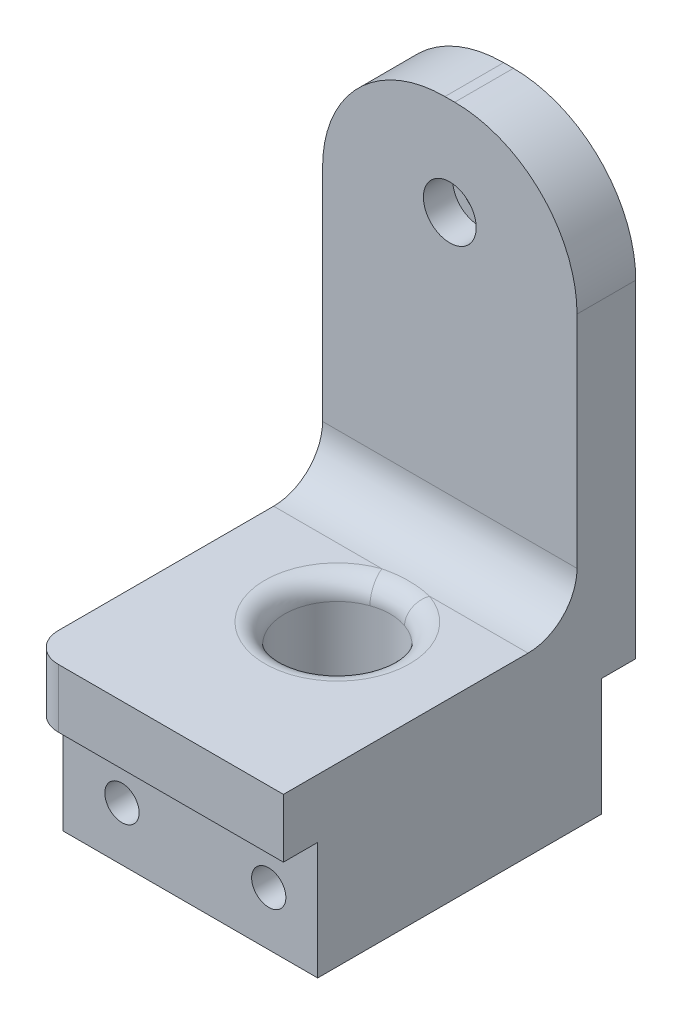
ISO-10303-21;
HEADER;
FILE_DESCRIPTION(('STEP AP214'),'2;1');
FILE_NAME('part.step','',(''),(''),'','','');
FILE_SCHEMA(('AUTOMOTIVE_DESIGN { 1 0 10303 214 1 1 1 1 }'));
ENDSEC;
DATA;
#1=APPLICATION_CONTEXT('core data for automotive mechanical design processes');
#2=APPLICATION_PROTOCOL_DEFINITION('international standard','automotive_design',2000,#1);
#3=PRODUCT_CONTEXT('',#1,'mechanical');
#4=PRODUCT('Part','Part','',(#3));
#5=PRODUCT_RELATED_PRODUCT_CATEGORY('part','',(#4));
#6=PRODUCT_DEFINITION_FORMATION('','',#4);
#7=PRODUCT_DEFINITION_CONTEXT('part definition',#1,'design');
#8=PRODUCT_DEFINITION('design','',#6,#7);
#9=PRODUCT_DEFINITION_SHAPE('','',#8);
#10=(LENGTH_UNIT() NAMED_UNIT(*) SI_UNIT(.MILLI.,.METRE.));
#11=(NAMED_UNIT(*) PLANE_ANGLE_UNIT() SI_UNIT($,.RADIAN.));
#12=(NAMED_UNIT(*) SI_UNIT($,.STERADIAN.) SOLID_ANGLE_UNIT());
#13=UNCERTAINTY_MEASURE_WITH_UNIT(LENGTH_MEASURE(1.E-05),#10,'distance_accuracy_value','');
#14=(GEOMETRIC_REPRESENTATION_CONTEXT(3) GLOBAL_UNCERTAINTY_ASSIGNED_CONTEXT((#13)) GLOBAL_UNIT_ASSIGNED_CONTEXT((#10,
#11,#12)) REPRESENTATION_CONTEXT('',''));
#15=CARTESIAN_POINT('',(0.,0.,0.));
#16=DIRECTION('',(0.,0.,1.));
#17=DIRECTION('',(1.,0.,0.));
#18=AXIS2_PLACEMENT_3D('',#15,#16,#17);
#19=CARTESIAN_POINT('',(37.2641007815364,-7.9999999999999,-28.));
#20=DIRECTION('',(0.,0.,1.));
#21=DIRECTION('',(1.,0.,0.));
#22=AXIS2_PLACEMENT_3D('',#19,#20,#21);
#23=CYLINDRICAL_SURFACE('',#22,2.7);
#24=CARTESIAN_POINT('',(37.2641007815364,-7.9999999999999,-22.));
#25=DIRECTION('',(0.,0.,1.));
#26=DIRECTION('',(1.,0.,0.));
#27=AXIS2_PLACEMENT_3D('',#24,#25,#26);
#28=CIRCLE('',#27,2.7);
#29=CARTESIAN_POINT('',(39.9641007815364,-7.9999999999999,-22.));
#30=VERTEX_POINT('',#29);
#31=EDGE_CURVE('E368',#30,#30,#28,.T.);
#32=ORIENTED_EDGE('',*,*,#31,.T.);
#33=EDGE_LOOP('',(#32));
#34=FACE_BOUND('',#33,.T.);
#35=CARTESIAN_POINT('',(37.2641007815364,-7.9999999999999,-25.));
#36=DIRECTION('',(0.,0.,-1.));
#37=DIRECTION('',(0.,1.,0.));
#38=AXIS2_PLACEMENT_3D('',#35,#36,#37);
#39=CIRCLE('',#38,2.7);
#40=CARTESIAN_POINT('',(37.2641007815364,-5.29999999999991,-25.));
#41=VERTEX_POINT('',#40);
#42=EDGE_CURVE('E11',#41,#41,#39,.F.);
#43=ORIENTED_EDGE('',*,*,#42,.F.);
#44=EDGE_LOOP('',(#43));
#45=FACE_BOUND('',#44,.T.);
#46=ADVANCED_FACE('F34',(#34,#45),#23,.F.);
#47=CARTESIAN_POINT('',(24.2641007815365,-38.,5.00000000000002));
#48=DIRECTION('',(1.,0.,0.));
#49=DIRECTION('',(0.,1.,0.));
#50=AXIS2_PLACEMENT_3D('',#47,#48,#49);
#51=PLANE('',#50);
#52=DIRECTION('',(0.,0.,1.));
#53=VECTOR('',#52,1.);
#54=CARTESIAN_POINT('',(24.2641007815365,-10.5,5.00000000000002));
#55=LINE('',#54,#53);
#56=CARTESIAN_POINT('',(24.2641007815365,-10.5,-22.));
#57=VERTEX_POINT('',#56);
#58=CARTESIAN_POINT('',(24.2641007815365,-10.5,-25.));
#59=VERTEX_POINT('',#58);
#60=EDGE_CURVE('E190',#57,#59,#55,.F.);
#61=ORIENTED_EDGE('',*,*,#60,.T.);
#62=DIRECTION('',(0.,-1.,0.));
#63=VECTOR('',#62,1.);
#64=CARTESIAN_POINT('',(24.2641007815365,-38.,-25.));
#65=LINE('',#64,#63);
#66=CARTESIAN_POINT('',(24.2641007815365,-44.,-25.));
#67=VERTEX_POINT('',#66);
#68=EDGE_CURVE('E174',#59,#67,#65,.T.);
#69=ORIENTED_EDGE('',*,*,#68,.T.);
#70=DIRECTION('',(0.,0.,1.));
#71=VECTOR('',#70,1.);
#72=CARTESIAN_POINT('',(24.2641007815365,-44.,5.00000000000002));
#73=LINE('',#72,#71);
#74=CARTESIAN_POINT('',(24.2641007815365,-44.,-24.5000000000061));
#75=VERTEX_POINT('',#74);
#76=EDGE_CURVE('E324',#67,#75,#73,.T.);
#77=ORIENTED_EDGE('',*,*,#76,.T.);
#78=DIRECTION('',(0.,1.,0.));
#79=VECTOR('',#78,1.);
#80=CARTESIAN_POINT('',(24.2641007815351,-56.,-24.5000000000061));
#81=LINE('',#80,#79);
#82=CARTESIAN_POINT('',(24.2641007815351,-56.,-24.5000000000061));
#83=VERTEX_POINT('',#82);
#84=EDGE_CURVE('E406',#83,#75,#81,.T.);
#85=ORIENTED_EDGE('',*,*,#84,.F.);
#86=DIRECTION('',(0.,0.,-1.));
#87=VECTOR('',#86,1.);
#88=CARTESIAN_POINT('',(24.2641007815351,-56.,4.49999999999388));
#89=LINE('',#88,#87);
#90=CARTESIAN_POINT('',(24.2641007815351,-56.,4.49999999999388));
#91=VERTEX_POINT('',#90);
#92=EDGE_CURVE('E419',#91,#83,#89,.T.);
#93=ORIENTED_EDGE('',*,*,#92,.F.);
#94=DIRECTION('',(0.,1.,0.));
#95=VECTOR('',#94,1.);
#96=CARTESIAN_POINT('',(24.2641007815351,-56.,4.49999999999388));
#97=LINE('',#96,#95);
#98=CARTESIAN_POINT('',(24.2641007815365,-44.,4.49999999999388));
#99=VERTEX_POINT('',#98);
#100=EDGE_CURVE('E386',#91,#99,#97,.T.);
#101=ORIENTED_EDGE('',*,*,#100,.T.);
#102=CARTESIAN_POINT('',(24.2641007815365,-44.,5.00000000000002));
#103=VERTEX_POINT('',#102);
#104=EDGE_CURVE('E380',#99,#103,#73,.T.);
#105=ORIENTED_EDGE('',*,*,#104,.T.);
#106=DIRECTION('',(0.,-1.,0.));
#107=VECTOR('',#106,1.);
#108=CARTESIAN_POINT('',(24.2641007815365,-38.,5.00000000000002));
#109=LINE('',#108,#107);
#110=CARTESIAN_POINT('',(24.2641007815365,-38.,5.00000000000002));
#111=VERTEX_POINT('',#110);
#112=EDGE_CURVE('E321',#111,#103,#109,.T.);
#113=ORIENTED_EDGE('',*,*,#112,.F.);
#114=DIRECTION('',(0.,0.,1.));
#115=VECTOR('',#114,1.);
#116=CARTESIAN_POINT('',(24.2641007815365,-38.,5.00000000000002));
#117=LINE('',#116,#115);
#118=CARTESIAN_POINT('',(24.2641007815365,-38.,-17.));
#119=VERTEX_POINT('',#118);
#120=EDGE_CURVE('E339',#119,#111,#117,.T.);
#121=ORIENTED_EDGE('',*,*,#120,.F.);
#122=CARTESIAN_POINT('',(24.2641007815365,-33.,-17.));
#123=DIRECTION('',(1.,0.,0.));
#124=DIRECTION('',(0.,1.,0.));
#125=AXIS2_PLACEMENT_3D('',#122,#123,#124);
#126=CIRCLE('',#125,5.);
#127=CARTESIAN_POINT('',(24.2641007815365,-33.,-22.));
#128=VERTEX_POINT('',#127);
#129=EDGE_CURVE('E179',#119,#128,#126,.T.);
#130=ORIENTED_EDGE('',*,*,#129,.T.);
#131=DIRECTION('',(0.,-1.,0.));
#132=VECTOR('',#131,1.);
#133=CARTESIAN_POINT('',(24.2641007815365,2.00000000000004,-22.));
#134=LINE('',#133,#132);
#135=EDGE_CURVE('E355',#57,#128,#134,.T.);
#136=ORIENTED_EDGE('',*,*,#135,.F.);
#137=EDGE_LOOP('',(#61,#69,#77,#85,#93,#101,#105,#113,#121,#130,#136));
#138=FACE_BOUND('',#137,.T.);
#139=ADVANCED_FACE('F269',(#138),#51,.F.);
#140=CARTESIAN_POINT('',(27.2641007815365,-44.,-25.));
#141=DIRECTION('',(0.,1.,0.));
#142=DIRECTION('',(-1.,0.,0.));
#143=AXIS2_PLACEMENT_3D('',#140,#141,#142);
#144=PLANE('',#143);
#145=DIRECTION('',(-1.,0.,0.));
#146=VECTOR('',#145,1.);
#147=CARTESIAN_POINT('',(24.2641007815351,-44.,4.49999999999388));
#148=LINE('',#147,#146);
#149=CARTESIAN_POINT('',(50.2641007815364,-44.,4.49999999999388));
#150=VERTEX_POINT('',#149);
#151=EDGE_CURVE('E388',#150,#99,#148,.T.);
#152=ORIENTED_EDGE('',*,*,#151,.F.);
#153=DIRECTION('',(0.,0.,-1.));
#154=VECTOR('',#153,1.);
#155=CARTESIAN_POINT('',(50.2641007815364,-44.,8.00000000000001));
#156=LINE('',#155,#154);
#157=CARTESIAN_POINT('',(50.2641007815364,-44.,8.00000000000001));
#158=VERTEX_POINT('',#157);
#159=EDGE_CURVE('E333',#158,#150,#156,.T.);
#160=ORIENTED_EDGE('',*,*,#159,.F.);
#161=DIRECTION('',(1.,0.,0.));
#162=VECTOR('',#161,1.);
#163=CARTESIAN_POINT('',(50.2641007815364,-44.,8.00000000000001));
#164=LINE('',#163,#162);
#165=CARTESIAN_POINT('',(27.2641007815365,-44.,8.00000000000002));
#166=VERTEX_POINT('',#165);
#167=EDGE_CURVE('E323',#166,#158,#164,.T.);
#168=ORIENTED_EDGE('',*,*,#167,.F.);
#169=CARTESIAN_POINT('',(27.2641007815365,-44.,5.00000000000002));
#170=DIRECTION('',(0.,1.,0.));
#171=DIRECTION('',(-1.,0.,0.));
#172=AXIS2_PLACEMENT_3D('',#169,#170,#171);
#173=CIRCLE('',#172,3.);
#174=EDGE_CURVE('E315',#103,#166,#173,.T.);
#175=ORIENTED_EDGE('',*,*,#174,.F.);
#176=ORIENTED_EDGE('',*,*,#104,.F.);
#177=EDGE_LOOP('',(#152,#160,#168,#175,#176));
#178=FACE_BOUND('',#177,.T.);
#179=ADVANCED_FACE('F275',(#178),#144,.F.);
#180=DIRECTION('',(1.,0.,0.));
#181=VECTOR('',#180,1.);
#182=CARTESIAN_POINT('',(50.264100781536,-44.,-24.5000000000061));
#183=LINE('',#182,#181);
#184=CARTESIAN_POINT('',(50.264100781536,-44.,-24.5000000000061));
#185=VERTEX_POINT('',#184);
#186=EDGE_CURVE('E391',#75,#185,#183,.T.);
#187=ORIENTED_EDGE('',*,*,#186,.F.);
#188=ORIENTED_EDGE('',*,*,#76,.F.);
#189=CARTESIAN_POINT('',(27.2641007815365,-44.,-25.));
#190=DIRECTION('',(0.,1.,0.));
#191=DIRECTION('',(-1.,0.,0.));
#192=AXIS2_PLACEMENT_3D('',#189,#190,#191);
#193=CIRCLE('',#192,3.);
#194=CARTESIAN_POINT('',(27.2641007815365,-44.,-28.));
#195=VERTEX_POINT('',#194);
#196=EDGE_CURVE('E373',#195,#67,#193,.T.);
#197=ORIENTED_EDGE('',*,*,#196,.F.);
#198=DIRECTION('',(-1.,0.,0.));
#199=VECTOR('',#198,1.);
#200=CARTESIAN_POINT('',(27.2641007815365,-44.,-28.));
#201=LINE('',#200,#199);
#202=CARTESIAN_POINT('',(50.2641007815364,-44.,-28.));
#203=VERTEX_POINT('',#202);
#204=EDGE_CURVE('E163',#203,#195,#201,.T.);
#205=ORIENTED_EDGE('',*,*,#204,.F.);
#206=EDGE_CURVE('E334',#185,#203,#156,.T.);
#207=ORIENTED_EDGE('',*,*,#206,.F.);
#208=EDGE_LOOP('',(#187,#188,#197,#205,#207));
#209=FACE_BOUND('',#208,.T.);
#210=ADVANCED_FACE('F294',(#209),#144,.F.);
#211=CARTESIAN_POINT('',(27.2641007815365,-38.,-25.));
#212=DIRECTION('',(0.,-1.,0.));
#213=DIRECTION('',(1.,0.,0.));
#214=AXIS2_PLACEMENT_3D('',#211,#212,#213);
#215=CYLINDRICAL_SURFACE('',#214,3.);
#216=ORIENTED_EDGE('',*,*,#196,.T.);
#217=ORIENTED_EDGE('',*,*,#68,.F.);
#218=CARTESIAN_POINT('',(27.2641007815365,-2.37596159536399,-28.));
#219=CARTESIAN_POINT('',(27.1983915563576,-2.45279744131092,-27.9999955976834));
#220=CARTESIAN_POINT('',(27.1336332208816,-2.53041391033352,-27.9978417404232));
#221=CARTESIAN_POINT('',(27.0061348726776,-2.68704359475026,-27.9895716775174));
#222=CARTESIAN_POINT('',(26.9433942499425,-2.76605637659331,-27.9834566814753));
#223=CARTESIAN_POINT('',(26.7585647009284,-3.00469045812072,-27.959704568562));
#224=CARTESIAN_POINT('',(26.6396007444813,-3.16622036865482,-27.9366575549089));
#225=CARTESIAN_POINT('',(26.4114725614061,-3.49197987139293,-27.8786750178079));
#226=CARTESIAN_POINT('',(26.3022386295532,-3.65617824575292,-27.8438344065246));
#227=CARTESIAN_POINT('',(26.092615906032,-3.98786265558461,-27.7640912771896));
#228=CARTESIAN_POINT('',(25.9922329943069,-4.1553507875322,-27.719182139508));
#229=CARTESIAN_POINT('',(25.7456081410414,-4.58934552659574,-27.5928509406924));
#230=CARTESIAN_POINT('',(25.6059101592015,-4.85778298644404,-27.505222332294));
#231=CARTESIAN_POINT('',(25.3481827231032,-5.39933018880595,-27.3140874879935));
#232=CARTESIAN_POINT('',(25.2301611975324,-5.67244160115889,-27.210575467659));
#233=CARTESIAN_POINT('',(25.014695207921,-6.22339230843005,-26.9909664833123));
#234=CARTESIAN_POINT('',(24.9173529043281,-6.50124806954949,-26.8748111382131));
#235=CARTESIAN_POINT('',(24.743394548052,-7.05935448987318,-26.6334491837794));
#236=CARTESIAN_POINT('',(24.6667743765311,-7.33960466171114,-26.5082443794409));
#237=CARTESIAN_POINT('',(24.4880428632665,-8.09465490011339,-26.1632015719856));
#238=CARTESIAN_POINT('',(24.4044538691434,-8.57114570459951,-25.9373197299402));
#239=CARTESIAN_POINT('',(24.2929474397417,-9.5251737303016,-25.4775191262234));
#240=CARTESIAN_POINT('',(24.2648830871325,-10.0027048339925,-25.2436232444146));
#241=CARTESIAN_POINT('',(24.2641061639584,-10.4866130721461,-25.0065582272683));
#242=CARTESIAN_POINT('',(24.2641007879001,-10.4933065692224,-25.0032790967264));
#243=CARTESIAN_POINT('',(24.2641007815365,-10.5,-25.));
#244=B_SPLINE_CURVE_WITH_KNOTS('',3,(#218,#219,#220,#221,#222,#223,#224,#225,#226,#227,#228,
#229,#230,#231,#232,#233,#234,#235,#236,#237,#238,#239,#240,#241,#242,#243),.UNSPECIFIED.,.F.,
.F.,(4,2,2,2,2,2,2,2,2,2,2,2,4),(0.,0.303232002971017,0.60637145232173,1.21142014160019,
1.81171094338183,2.41239757437573,3.35608082014014,4.300108556401,5.24869681288445,
6.19709638427291,7.79552777701962,9.38972405871274,9.41208474430548),.UNSPECIFIED.);
#245=CARTESIAN_POINT('',(27.2641007815365,-2.37596159536399,-28.));
#246=VERTEX_POINT('',#245);
#247=EDGE_CURVE('E171',#59,#246,#244,.F.);
#248=ORIENTED_EDGE('',*,*,#247,.T.);
#249=DIRECTION('',(0.,-1.,0.));
#250=VECTOR('',#249,1.);
#251=CARTESIAN_POINT('',(27.2641007815365,-38.,-28.));
#252=LINE('',#251,#250);
#253=EDGE_CURVE('E153',#246,#195,#252,.T.);
#254=ORIENTED_EDGE('',*,*,#253,.T.);
#255=EDGE_LOOP('',(#216,#217,#248,#254));
#256=FACE_BOUND('',#255,.T.);
#257=ADVANCED_FACE('F172',(#256),#215,.T.);
#258=CARTESIAN_POINT('',(27.2641007815365,-38.,5.00000000000002));
#259=DIRECTION('',(0.,-1.,0.));
#260=DIRECTION('',(1.,0.,0.));
#261=AXIS2_PLACEMENT_3D('',#258,#259,#260);
#262=CYLINDRICAL_SURFACE('',#261,3.);
#263=ORIENTED_EDGE('',*,*,#174,.T.);
#264=DIRECTION('',(0.,-1.,0.));
#265=VECTOR('',#264,1.);
#266=CARTESIAN_POINT('',(27.2641007815365,-38.,8.00000000000002));
#267=LINE('',#266,#265);
#268=CARTESIAN_POINT('',(27.2641007815365,-38.,8.00000000000002));
#269=VERTEX_POINT('',#268);
#270=EDGE_CURVE('E318',#269,#166,#267,.T.);
#271=ORIENTED_EDGE('',*,*,#270,.F.);
#272=CARTESIAN_POINT('',(27.2641007815365,-38.,5.00000000000002));
#273=DIRECTION('',(0.,1.,0.));
#274=DIRECTION('',(-1.,0.,0.));
#275=AXIS2_PLACEMENT_3D('',#272,#273,#274);
#276=CIRCLE('',#275,3.);
#277=EDGE_CURVE('E375',#111,#269,#276,.T.);
#278=ORIENTED_EDGE('',*,*,#277,.F.);
#279=ORIENTED_EDGE('',*,*,#112,.T.);
#280=EDGE_LOOP('',(#263,#271,#278,#279));
#281=FACE_BOUND('',#280,.T.);
#282=ADVANCED_FACE('F305',(#281),#262,.T.);
#283=CARTESIAN_POINT('',(50.2641007815364,-38.,8.00000000000001));
#284=DIRECTION('',(0.,0.,-1.));
#285=DIRECTION('',(-1.,0.,0.));
#286=AXIS2_PLACEMENT_3D('',#283,#284,#285);
#287=PLANE('',#286);
#288=ORIENTED_EDGE('',*,*,#167,.T.);
#289=DIRECTION('',(0.,-1.,0.));
#290=VECTOR('',#289,1.);
#291=CARTESIAN_POINT('',(50.2641007815364,-38.,8.00000000000001));
#292=LINE('',#291,#290);
#293=CARTESIAN_POINT('',(50.2641007815364,-38.,8.00000000000001));
#294=VERTEX_POINT('',#293);
#295=EDGE_CURVE('E329',#294,#158,#292,.T.);
#296=ORIENTED_EDGE('',*,*,#295,.F.);
#297=DIRECTION('',(1.,0.,0.));
#298=VECTOR('',#297,1.);
#299=CARTESIAN_POINT('',(50.2641007815364,-38.,8.00000000000001));
#300=LINE('',#299,#298);
#301=EDGE_CURVE('E328',#269,#294,#300,.T.);
#302=ORIENTED_EDGE('',*,*,#301,.F.);
#303=ORIENTED_EDGE('',*,*,#270,.T.);
#304=EDGE_LOOP('',(#288,#296,#302,#303));
#305=FACE_BOUND('',#304,.T.);
#306=ADVANCED_FACE('F301',(#305),#287,.F.);
#307=CARTESIAN_POINT('',(50.2641007815364,-38.,8.00000000000001));
#308=DIRECTION('',(-1.,0.,0.));
#309=DIRECTION('',(0.,-1.,0.));
#310=AXIS2_PLACEMENT_3D('',#307,#308,#309);
#311=PLANE('',#310);
#312=DIRECTION('',(0.,-1.,0.));
#313=VECTOR('',#312,1.);
#314=CARTESIAN_POINT('',(50.2641007815364,-38.,-28.));
#315=LINE('',#314,#313);
#316=CARTESIAN_POINT('',(50.2641007815364,-10.5,-28.));
#317=VERTEX_POINT('',#316);
#318=EDGE_CURVE('E167',#317,#203,#315,.T.);
#319=ORIENTED_EDGE('',*,*,#318,.F.);
#320=DIRECTION('',(0.,0.,-1.));
#321=VECTOR('',#320,1.);
#322=CARTESIAN_POINT('',(50.2641007815364,-10.5,8.00000000000001));
#323=LINE('',#322,#321);
#324=CARTESIAN_POINT('',(50.2641007815364,-10.5,-22.));
#325=VERTEX_POINT('',#324);
#326=EDGE_CURVE('E185',#317,#325,#323,.F.);
#327=ORIENTED_EDGE('',*,*,#326,.T.);
#328=DIRECTION('',(0.,-1.,0.));
#329=VECTOR('',#328,1.);
#330=CARTESIAN_POINT('',(50.2641007815364,2.00000000000004,-22.));
#331=LINE('',#330,#329);
#332=CARTESIAN_POINT('',(50.2641007815364,-33.,-22.));
#333=VERTEX_POINT('',#332);
#334=EDGE_CURVE('E364',#325,#333,#331,.T.);
#335=ORIENTED_EDGE('',*,*,#334,.T.);
#336=CARTESIAN_POINT('',(50.2641007815364,-33.,-17.));
#337=DIRECTION('',(-1.,0.,0.));
#338=DIRECTION('',(0.,-1.,0.));
#339=AXIS2_PLACEMENT_3D('',#336,#337,#338);
#340=CIRCLE('',#339,5.);
#341=CARTESIAN_POINT('',(50.2641007815364,-38.,-17.));
#342=VERTEX_POINT('',#341);
#343=EDGE_CURVE('E199',#333,#342,#340,.T.);
#344=ORIENTED_EDGE('',*,*,#343,.T.);
#345=DIRECTION('',(0.,0.,-1.));
#346=VECTOR('',#345,1.);
#347=CARTESIAN_POINT('',(50.2641007815364,-38.,8.00000000000001));
#348=LINE('',#347,#346);
#349=EDGE_CURVE('E168',#294,#342,#348,.T.);
#350=ORIENTED_EDGE('',*,*,#349,.F.);
#351=ORIENTED_EDGE('',*,*,#295,.T.);
#352=ORIENTED_EDGE('',*,*,#159,.T.);
#353=DIRECTION('',(0.,1.,0.));
#354=VECTOR('',#353,1.);
#355=CARTESIAN_POINT('',(50.264100781536,-56.,4.49999999999388));
#356=LINE('',#355,#354);
#357=CARTESIAN_POINT('',(50.264100781536,-56.,4.49999999999388));
#358=VERTEX_POINT('',#357);
#359=EDGE_CURVE('E397',#358,#150,#356,.T.);
#360=ORIENTED_EDGE('',*,*,#359,.F.);
#361=DIRECTION('',(0.,0.,1.));
#362=VECTOR('',#361,1.);
#363=CARTESIAN_POINT('',(50.264100781536,-56.,4.49999999999388));
#364=LINE('',#363,#362);
#365=CARTESIAN_POINT('',(50.264100781536,-56.,-24.5000000000061));
#366=VERTEX_POINT('',#365);
#367=EDGE_CURVE('E403',#366,#358,#364,.T.);
#368=ORIENTED_EDGE('',*,*,#367,.F.);
#369=DIRECTION('',(0.,1.,0.));
#370=VECTOR('',#369,1.);
#371=CARTESIAN_POINT('',(50.264100781536,-56.,-24.5000000000061));
#372=LINE('',#371,#370);
#373=EDGE_CURVE('E402',#366,#185,#372,.T.);
#374=ORIENTED_EDGE('',*,*,#373,.T.);
#375=ORIENTED_EDGE('',*,*,#206,.T.);
#376=EDGE_LOOP('',(#319,#327,#335,#344,#350,#351,#352,#360,#368,#374,#375));
#377=FACE_BOUND('',#376,.T.);
#378=ADVANCED_FACE('F298',(#377),#311,.F.);
#379=CARTESIAN_POINT('',(27.2641007815365,-38.,-28.));
#380=DIRECTION('',(0.,0.,1.));
#381=DIRECTION('',(0.,-1.,0.));
#382=AXIS2_PLACEMENT_3D('',#379,#380,#381);
#383=PLANE('',#382);
#384=ORIENTED_EDGE('',*,*,#253,.F.);
#385=CARTESIAN_POINT('',(36.7641007815365,-10.5,-28.));
#386=DIRECTION('',(0.,0.,1.));
#387=DIRECTION('',(0.,-1.,0.));
#388=AXIS2_PLACEMENT_3D('',#385,#386,#387);
#389=CIRCLE('',#388,12.5);
#390=CARTESIAN_POINT('',(36.7641007815365,2.00000000000004,-28.));
#391=VERTEX_POINT('',#390);
#392=EDGE_CURVE('E159',#246,#391,#389,.F.);
#393=ORIENTED_EDGE('',*,*,#392,.T.);
#394=DIRECTION('',(-1.,0.,0.));
#395=VECTOR('',#394,1.);
#396=CARTESIAN_POINT('',(50.2641007815364,2.00000000000004,-28.));
#397=LINE('',#396,#395);
#398=CARTESIAN_POINT('',(37.7641007815364,2.00000000000004,-28.));
#399=VERTEX_POINT('',#398);
#400=EDGE_CURVE('E361',#399,#391,#397,.T.);
#401=ORIENTED_EDGE('',*,*,#400,.F.);
#402=CARTESIAN_POINT('',(37.7641007815364,-10.5,-28.));
#403=DIRECTION('',(0.,0.,1.));
#404=DIRECTION('',(0.,-1.,0.));
#405=AXIS2_PLACEMENT_3D('',#402,#403,#404);
#406=CIRCLE('',#405,12.5);
#407=EDGE_CURVE('E186',#399,#317,#406,.F.);
#408=ORIENTED_EDGE('',*,*,#407,.T.);
#409=ORIENTED_EDGE('',*,*,#318,.T.);
#410=ORIENTED_EDGE('',*,*,#204,.T.);
#411=EDGE_LOOP('',(#384,#393,#401,#408,#409,#410));
#412=FACE_BOUND('',#411,.T.);
#413=CARTESIAN_POINT('',(37.2641007815364,-7.9999999999999,-28.));
#414=DIRECTION('',(0.,0.,-1.));
#415=DIRECTION('',(0.,1.,0.));
#416=AXIS2_PLACEMENT_3D('',#413,#414,#415);
#417=CIRCLE('',#416,1.6);
#418=CARTESIAN_POINT('',(37.2641007815364,-6.39999999999991,-28.));
#419=VERTEX_POINT('',#418);
#420=EDGE_CURVE('E547',#419,#419,#417,.T.);
#421=ORIENTED_EDGE('',*,*,#420,.F.);
#422=EDGE_LOOP('',(#421));
#423=FACE_BOUND('',#422,.T.);
#424=ADVANCED_FACE('F155',(#412,#423),#383,.F.);
#425=CARTESIAN_POINT('',(27.2641007815365,-38.,-25.));
#426=DIRECTION('',(0.,1.,0.));
#427=DIRECTION('',(-1.,0.,0.));
#428=AXIS2_PLACEMENT_3D('',#425,#426,#427);
#429=PLANE('',#428);
#430=DIRECTION('',(1.,0.,0.));
#431=VECTOR('',#430,1.);
#432=CARTESIAN_POINT('',(27.2641007815365,-38.,-17.));
#433=LINE('',#432,#431);
#434=CARTESIAN_POINT('',(40.1884047196501,-38.,-17.));
#435=VERTEX_POINT('',#434);
#436=EDGE_CURVE('E197',#342,#435,#433,.F.);
#437=ORIENTED_EDGE('',*,*,#436,.T.);
#438=CARTESIAN_POINT('',(37.7641007815366,-38.,-10.0083799863231));
#439=DIRECTION('',(0.,1.,0.));
#440=DIRECTION('',(-1.,0.,0.));
#441=AXIS2_PLACEMENT_3D('',#438,#439,#440);
#442=CIRCLE('',#441,7.4);
#443=CARTESIAN_POINT('',(35.339796843423,-38.,-17.));
#444=VERTEX_POINT('',#443);
#445=EDGE_CURVE('E42',#435,#444,#442,.F.);
#446=ORIENTED_EDGE('',*,*,#445,.T.);
#447=EDGE_CURVE('E196',#444,#119,#433,.F.);
#448=ORIENTED_EDGE('',*,*,#447,.T.);
#449=ORIENTED_EDGE('',*,*,#120,.T.);
#450=ORIENTED_EDGE('',*,*,#277,.T.);
#451=ORIENTED_EDGE('',*,*,#301,.T.);
#452=ORIENTED_EDGE('',*,*,#349,.T.);
#453=EDGE_LOOP('',(#437,#446,#448,#449,#450,#451,#452));
#454=FACE_BOUND('',#453,.T.);
#455=ADVANCED_FACE('F288',(#454),#429,.T.);
#456=CARTESIAN_POINT('',(50.2641007815364,2.00000000000004,-22.));
#457=DIRECTION('',(0.,0.,-1.));
#458=DIRECTION('',(-1.,0.,0.));
#459=AXIS2_PLACEMENT_3D('',#456,#457,#458);
#460=PLANE('',#459);
#461=ORIENTED_EDGE('',*,*,#31,.F.);
#462=EDGE_LOOP('',(#461));
#463=FACE_BOUND('',#462,.T.);
#464=ORIENTED_EDGE('',*,*,#135,.T.);
#465=DIRECTION('',(1.,0.,0.));
#466=VECTOR('',#465,1.);
#467=CARTESIAN_POINT('',(50.2641007815364,-33.,-22.));
#468=LINE('',#467,#466);
#469=EDGE_CURVE('E188',#128,#333,#468,.T.);
#470=ORIENTED_EDGE('',*,*,#469,.T.);
#471=ORIENTED_EDGE('',*,*,#334,.F.);
#472=CARTESIAN_POINT('',(37.7641007815364,-10.5,-22.));
#473=DIRECTION('',(0.,0.,-1.));
#474=DIRECTION('',(-1.,0.,0.));
#475=AXIS2_PLACEMENT_3D('',#472,#473,#474);
#476=CIRCLE('',#475,12.5);
#477=CARTESIAN_POINT('',(37.7641007815364,2.00000000000004,-22.));
#478=VERTEX_POINT('',#477);
#479=EDGE_CURVE('E349',#325,#478,#476,.F.);
#480=ORIENTED_EDGE('',*,*,#479,.T.);
#481=DIRECTION('',(1.,0.,0.));
#482=VECTOR('',#481,1.);
#483=CARTESIAN_POINT('',(50.2641007815364,2.00000000000004,-22.));
#484=LINE('',#483,#482);
#485=CARTESIAN_POINT('',(36.7641007815365,2.00000000000004,-22.));
#486=VERTEX_POINT('',#485);
#487=EDGE_CURVE('E359',#486,#478,#484,.T.);
#488=ORIENTED_EDGE('',*,*,#487,.F.);
#489=CARTESIAN_POINT('',(36.7641007815365,-10.5,-22.));
#490=DIRECTION('',(0.,0.,-1.));
#491=DIRECTION('',(-1.,0.,0.));
#492=AXIS2_PLACEMENT_3D('',#489,#490,#491);
#493=CIRCLE('',#492,12.5);
#494=EDGE_CURVE('E351',#486,#57,#493,.F.);
#495=ORIENTED_EDGE('',*,*,#494,.T.);
#496=EDGE_LOOP('',(#464,#470,#471,#480,#488,#495));
#497=FACE_BOUND('',#496,.T.);
#498=ADVANCED_FACE('F284',(#463,#497),#460,.F.);
#499=CARTESIAN_POINT('',(0.,2.00000000000005,0.));
#500=DIRECTION('',(0.,-1.,0.));
#501=DIRECTION('',(1.,0.,0.));
#502=AXIS2_PLACEMENT_3D('',#499,#500,#501);
#503=PLANE('',#502);
#504=ORIENTED_EDGE('',*,*,#400,.T.);
#505=DIRECTION('',(0.,0.,1.));
#506=VECTOR('',#505,1.);
#507=CARTESIAN_POINT('',(36.7641007815365,2.00000000000004,0.));
#508=LINE('',#507,#506);
#509=EDGE_CURVE('E184',#391,#486,#508,.T.);
#510=ORIENTED_EDGE('',*,*,#509,.T.);
#511=ORIENTED_EDGE('',*,*,#487,.T.);
#512=DIRECTION('',(0.,0.,-1.));
#513=VECTOR('',#512,1.);
#514=CARTESIAN_POINT('',(37.7641007815364,2.00000000000004,0.));
#515=LINE('',#514,#513);
#516=EDGE_CURVE('E345',#478,#399,#515,.T.);
#517=ORIENTED_EDGE('',*,*,#516,.T.);
#518=EDGE_LOOP('',(#504,#510,#511,#517));
#519=FACE_BOUND('',#518,.T.);
#520=ADVANCED_FACE('F222',(#519),#503,.F.);
#521=CARTESIAN_POINT('',(36.7641007815365,-10.5,0.));
#522=DIRECTION('',(0.,0.,1.));
#523=DIRECTION('',(1.,0.,0.));
#524=AXIS2_PLACEMENT_3D('',#521,#522,#523);
#525=CYLINDRICAL_SURFACE('',#524,12.5);
#526=ORIENTED_EDGE('',*,*,#247,.F.);
#527=ORIENTED_EDGE('',*,*,#60,.F.);
#528=ORIENTED_EDGE('',*,*,#494,.F.);
#529=ORIENTED_EDGE('',*,*,#509,.F.);
#530=ORIENTED_EDGE('',*,*,#392,.F.);
#531=EDGE_LOOP('',(#526,#527,#528,#529,#530));
#532=FACE_BOUND('',#531,.T.);
#533=ADVANCED_FACE('F182',(#532),#525,.T.);
#534=CARTESIAN_POINT('',(37.7641007815364,-10.5,0.));
#535=DIRECTION('',(0.,0.,-1.));
#536=DIRECTION('',(-1.,0.,0.));
#537=AXIS2_PLACEMENT_3D('',#534,#535,#536);
#538=CYLINDRICAL_SURFACE('',#537,12.5);
#539=ORIENTED_EDGE('',*,*,#479,.F.);
#540=ORIENTED_EDGE('',*,*,#326,.F.);
#541=ORIENTED_EDGE('',*,*,#407,.F.);
#542=ORIENTED_EDGE('',*,*,#516,.F.);
#543=EDGE_LOOP('',(#539,#540,#541,#542));
#544=FACE_BOUND('',#543,.T.);
#545=ADVANCED_FACE('F221',(#544),#538,.T.);
#546=CARTESIAN_POINT('',(24.2641007815351,-56.,4.49999999999388));
#547=DIRECTION('',(0.,0.,-1.));
#548=DIRECTION('',(-1.,0.,0.));
#549=AXIS2_PLACEMENT_3D('',#546,#547,#548);
#550=PLANE('',#549);
#551=CARTESIAN_POINT('',(45.2641007815367,-50.5,4.49999999999388));
#552=DIRECTION('',(0.,0.,-1.));
#553=DIRECTION('',(-1.,0.,0.));
#554=AXIS2_PLACEMENT_3D('',#551,#552,#553);
#555=CIRCLE('',#554,1.75);
#556=CARTESIAN_POINT('',(43.5141007815367,-50.5,4.49999999999388));
#557=VERTEX_POINT('',#556);
#558=EDGE_CURVE('E392',#557,#557,#555,.T.);
#559=ORIENTED_EDGE('',*,*,#558,.T.);
#560=EDGE_LOOP('',(#559));
#561=FACE_BOUND('',#560,.T.);
#562=CARTESIAN_POINT('',(30.2641007815367,-50.5,4.49999999999388));
#563=DIRECTION('',(0.,0.,-1.));
#564=DIRECTION('',(-1.,0.,0.));
#565=AXIS2_PLACEMENT_3D('',#562,#563,#564);
#566=CIRCLE('',#565,1.75);
#567=CARTESIAN_POINT('',(28.5141007815366,-50.5,4.49999999999388));
#568=VERTEX_POINT('',#567);
#569=EDGE_CURVE('E554',#568,#568,#566,.T.);
#570=ORIENTED_EDGE('',*,*,#569,.T.);
#571=EDGE_LOOP('',(#570));
#572=FACE_BOUND('',#571,.T.);
#573=ORIENTED_EDGE('',*,*,#151,.T.);
#574=ORIENTED_EDGE('',*,*,#100,.F.);
#575=DIRECTION('',(-1.,0.,0.));
#576=VECTOR('',#575,1.);
#577=CARTESIAN_POINT('',(24.2641007815351,-56.,4.49999999999388));
#578=LINE('',#577,#576);
#579=EDGE_CURVE('E401',#358,#91,#578,.T.);
#580=ORIENTED_EDGE('',*,*,#579,.F.);
#581=ORIENTED_EDGE('',*,*,#359,.T.);
#582=EDGE_LOOP('',(#573,#574,#580,#581));
#583=FACE_BOUND('',#582,.T.);
#584=ADVANCED_FACE('F226',(#561,#572,#583),#550,.F.);
#585=CARTESIAN_POINT('',(50.264100781536,-56.,-24.5000000000061));
#586=DIRECTION('',(0.,0.,1.));
#587=DIRECTION('',(1.,0.,0.));
#588=AXIS2_PLACEMENT_3D('',#585,#586,#587);
#589=PLANE('',#588);
#590=CARTESIAN_POINT('',(45.2641007815365,-50.5,-24.5000000000064));
#591=DIRECTION('',(0.,0.,-1.));
#592=DIRECTION('',(-1.,0.,0.));
#593=AXIS2_PLACEMENT_3D('',#590,#591,#592);
#594=CIRCLE('',#593,1.75);
#595=CARTESIAN_POINT('',(43.5141007815365,-50.5,-24.5000000000064));
#596=VERTEX_POINT('',#595);
#597=EDGE_CURVE('E551',#596,#596,#594,.T.);
#598=ORIENTED_EDGE('',*,*,#597,.F.);
#599=EDGE_LOOP('',(#598));
#600=FACE_BOUND('',#599,.T.);
#601=CARTESIAN_POINT('',(30.2641007815365,-50.5,-24.5000000000063));
#602=DIRECTION('',(0.,0.,-1.));
#603=DIRECTION('',(-1.,0.,0.));
#604=AXIS2_PLACEMENT_3D('',#601,#602,#603);
#605=CIRCLE('',#604,1.75);
#606=CARTESIAN_POINT('',(28.5141007815365,-50.5,-24.5000000000063));
#607=VERTEX_POINT('',#606);
#608=EDGE_CURVE('E555',#607,#607,#605,.T.);
#609=ORIENTED_EDGE('',*,*,#608,.F.);
#610=EDGE_LOOP('',(#609));
#611=FACE_BOUND('',#610,.T.);
#612=ORIENTED_EDGE('',*,*,#186,.T.);
#613=ORIENTED_EDGE('',*,*,#373,.F.);
#614=DIRECTION('',(1.,0.,0.));
#615=VECTOR('',#614,1.);
#616=CARTESIAN_POINT('',(50.264100781536,-56.,-24.5000000000061));
#617=LINE('',#616,#615);
#618=EDGE_CURVE('E408',#83,#366,#617,.T.);
#619=ORIENTED_EDGE('',*,*,#618,.F.);
#620=ORIENTED_EDGE('',*,*,#84,.T.);
#621=EDGE_LOOP('',(#612,#613,#619,#620));
#622=FACE_BOUND('',#621,.T.);
#623=ADVANCED_FACE('F417',(#600,#611,#622),#589,.F.);
#624=CARTESIAN_POINT('',(0.,-56.,0.));
#625=DIRECTION('',(0.,1.,0.));
#626=DIRECTION('',(-1.,0.,0.));
#627=AXIS2_PLACEMENT_3D('',#624,#625,#626);
#628=PLANE('',#627);
#629=CARTESIAN_POINT('',(37.7641007815365,-56.,-10.0083799863231));
#630=DIRECTION('',(0.,1.,0.));
#631=DIRECTION('',(-1.,0.,0.));
#632=AXIS2_PLACEMENT_3D('',#629,#630,#631);
#633=CIRCLE('',#632,7.4);
#634=CARTESIAN_POINT('',(30.3641007815365,-56.,-10.0083799863231));
#635=VERTEX_POINT('',#634);
#636=EDGE_CURVE('E251',#635,#635,#633,.T.);
#637=ORIENTED_EDGE('',*,*,#636,.T.);
#638=EDGE_LOOP('',(#637));
#639=FACE_BOUND('',#638,.T.);
#640=ORIENTED_EDGE('',*,*,#579,.T.);
#641=ORIENTED_EDGE('',*,*,#92,.T.);
#642=ORIENTED_EDGE('',*,*,#618,.T.);
#643=ORIENTED_EDGE('',*,*,#367,.T.);
#644=EDGE_LOOP('',(#640,#641,#642,#643));
#645=FACE_BOUND('',#644,.T.);
#646=ADVANCED_FACE('F232',(#639,#645),#628,.F.);
#647=CARTESIAN_POINT('',(50.2641007815364,-33.,-17.));
#648=DIRECTION('',(1.,0.,0.));
#649=DIRECTION('',(0.,0.,-1.));
#650=AXIS2_PLACEMENT_3D('',#647,#648,#649);
#651=CYLINDRICAL_SURFACE('',#650,5.);
#652=ORIENTED_EDGE('',*,*,#447,.F.);
#653=CARTESIAN_POINT('',(34.517514142929,-39.9164335190876,-14.3234321526375));
#654=CARTESIAN_POINT('',(34.6863208597517,-37.6628878132712,-14.4504400334743));
#655=CARTESIAN_POINT('',(33.3150746471484,-37.9403096564911,-16.2297140154592));
#656=CARTESIAN_POINT('',(34.6291477939411,-39.9343611684028,-14.4074512575042));
#657=CARTESIAN_POINT('',(34.7746305064438,-37.7024118229976,-14.5101658014829));
#658=CARTESIAN_POINT('',(33.4680540948263,-37.9531151195774,-16.3119549382914));
#659=CARTESIAN_POINT('',(34.7442411573527,-39.9484870831983,-14.4872336981611));
#660=CARTESIAN_POINT('',(34.8690265060091,-37.7393043859726,-14.5706751860718));
#661=CARTESIAN_POINT('',(33.6257746298714,-37.9632050586776,-16.3900488616923));
#662=CARTESIAN_POINT('',(34.9804315995229,-39.9707457294369,-14.6377123438233));
#663=CARTESIAN_POINT('',(35.0682240160191,-37.8070726714729,-14.6897676103281));
#664=CARTESIAN_POINT('',(33.9494430135884,-37.9791040920207,-16.5373427740799));
#665=CARTESIAN_POINT('',(35.1015252857763,-39.9788818071076,-14.7084136037842));
#666=CARTESIAN_POINT('',(35.1729246192043,-37.8380327201663,-14.7483914773638));
#667=CARTESIAN_POINT('',(34.1153862132715,-37.9849155764261,-16.6065477110392));
#668=CARTESIAN_POINT('',(35.3488516294691,-39.9907838494989,-14.8401718408429));
#669=CARTESIAN_POINT('',(35.392159978475,-37.8939301781051,-14.8613230920801));
#670=CARTESIAN_POINT('',(34.4543149064822,-37.9934170354356,-16.735517413954));
#671=CARTESIAN_POINT('',(35.4750810941873,-39.9945524875914,-14.9012346979477));
#672=CARTESIAN_POINT('',(35.5066681200014,-37.9189606804992,-14.9157269834032));
#673=CARTESIAN_POINT('',(34.6272960247989,-37.9961089195914,-16.795287935472));
#674=CARTESIAN_POINT('',(35.7319470665739,-39.9991605568255,-15.0133765782262));
#675=CARTESIAN_POINT('',(35.7443617300041,-37.9634246913953,-15.0181014167678));
#676=CARTESIAN_POINT('',(34.9792975425134,-37.9994003975703,-16.905056442631));
#677=CARTESIAN_POINT('',(35.8625843601467,-39.9999994627871,-15.0644538098408));
#678=CARTESIAN_POINT('',(35.8676088869467,-37.982940149038,-15.0661977093746));
#679=CARTESIAN_POINT('',(35.1583190188911,-37.9999996162649,-16.9550526746295));
#680=CARTESIAN_POINT('',(36.1384077045095,-40.0000005816885,-15.1600937608451));
#681=CARTESIAN_POINT('',(36.1317526059064,-38.0183095936733,-15.1577843482516));
#682=CARTESIAN_POINT('',(35.5362991574626,-38.0000004155043,-17.0486684996801));
#683=CARTESIAN_POINT('',(36.2839028371744,-39.9990182317931,-15.2037670559348));
#684=CARTESIAN_POINT('',(36.2735320688652,-38.0338240672478,-15.2007659433096));
#685=CARTESIAN_POINT('',(35.7356813762995,-37.9992987368572,-17.091417492227));
#686=CARTESIAN_POINT('',(36.5780529635468,-39.9963867852615,-15.2787051970524));
#687=CARTESIAN_POINT('',(36.5634715548075,-38.0596675743335,-15.2753469457233));
#688=CARTESIAN_POINT('',(36.138775993921,-37.9974191321672,-17.1647696409415));
#689=CARTESIAN_POINT('',(36.726708077816,-39.9947376631428,-15.3099695687492));
#690=CARTESIAN_POINT('',(36.7118949674664,-38.070060509812,-15.3071055988565));
#691=CARTESIAN_POINT('',(36.3424885579195,-37.9962411879226,-17.1953723328167));
#692=CARTESIAN_POINT('',(37.0261094970128,-39.9917293651315,-15.3598656263231));
#693=CARTESIAN_POINT('',(37.012871704717,-38.0863071476423,-15.3580528880445));
#694=CARTESIAN_POINT('',(36.7527793916336,-37.9940924037019,-17.244212389173));
#695=CARTESIAN_POINT('',(37.1768555752828,-39.9903701580702,-15.3784986706653));
#696=CARTESIAN_POINT('',(37.1657563369588,-38.0922020606824,-15.3773626024288));
#697=CARTESIAN_POINT('',(36.9593573507444,-37.9931215414625,-17.2624510833687));
#698=CARTESIAN_POINT('',(37.4793805373436,-39.9885244362797,-15.4030035772644));
#699=CARTESIAN_POINT('',(37.4733609819092,-38.0998877649921,-15.4027524249961));
#700=CARTESIAN_POINT('',(37.3739285950499,-37.9918031687356,-17.2864373676057));
#701=CARTESIAN_POINT('',(37.6311593886314,-39.9880378942127,-15.4088758392768));
#702=CARTESIAN_POINT('',(37.6284553678755,-38.1016979193605,-15.4088957073414));
#703=CARTESIAN_POINT('',(37.5819218357035,-37.9914556387212,-17.2921853489419));
#704=CARTESIAN_POINT('',(37.9315456711055,-39.9881212929653,-15.4078294677583));
#705=CARTESIAN_POINT('',(37.9349697340414,-38.1013735381709,-15.4078073050603));
#706=CARTESIAN_POINT('',(37.9935622968718,-37.9915152092631,-17.2911611228526));
#707=CARTESIAN_POINT('',(38.0801540794483,-39.9886696951437,-15.401171611486));
#708=CARTESIAN_POINT('',(38.0867683832607,-38.0993186973994,-15.4008458469877));
#709=CARTESIAN_POINT('',(38.1972108564527,-37.991906925077,-17.2846441735902));
#710=CARTESIAN_POINT('',(38.3763130182644,-39.9905781174799,-15.3756219622788));
#711=CARTESIAN_POINT('',(38.3877570240426,-38.0912924080796,-15.374389231239));
#712=CARTESIAN_POINT('',(38.6030582911265,-37.9932700839035,-17.2596352576997));
#713=CARTESIAN_POINT('',(38.5238635503468,-39.9919381364028,-15.3567301879584));
#714=CARTESIAN_POINT('',(38.5372970195361,-38.0853016935646,-15.3548315061161));
#715=CARTESIAN_POINT('',(38.8052571684247,-37.9942415260339,-17.2411433092922));
#716=CARTESIAN_POINT('',(38.8169040274508,-39.9949039147896,-15.3068417226481));
#717=CARTESIAN_POINT('',(38.8316887796311,-38.0690246023886,-15.3039345234252));
#718=CARTESIAN_POINT('',(39.2068311555671,-37.9963599391035,-17.1923106845168));
#719=CARTESIAN_POINT('',(38.962393936946,-39.9965096784847,-15.275844823222));
#720=CARTESIAN_POINT('',(38.9768499131545,-38.0586990197761,-15.2724806813665));
#721=CARTESIAN_POINT('',(39.4062062167273,-37.9975069130651,-17.1619698041241));
#722=CARTESIAN_POINT('',(39.2503229783078,-39.999057925094,-15.2019560787));
#723=CARTESIAN_POINT('',(39.2605162847265,-38.0331831328948,-15.198992283628));
#724=CARTESIAN_POINT('',(39.8007756437787,-37.9993270892397,-17.0896448425535));
#725=CARTESIAN_POINT('',(39.3927622020848,-40.000000428018,-15.1590645925059));
#726=CARTESIAN_POINT('',(39.3992672071625,-38.0179323247833,-15.1568075827009));
#727=CARTESIAN_POINT('',(39.9959701356211,-38.0000003057455,-17.0476611126815));
#728=CARTESIAN_POINT('',(39.6656006789115,-39.9999995964026,-15.0644594588383));
#729=CARTESIAN_POINT('',(39.660576374931,-37.9829422355471,-15.0662029741518));
#730=CARTESIAN_POINT('',(40.3698599001616,-37.9999997116988,-16.9550582040715));
#731=CARTESIAN_POINT('',(39.7962231928702,-39.9991607906619,-15.0133887867194));
#732=CARTESIAN_POINT('',(39.783810070624,-37.9634293722759,-15.0181129182741));
#733=CARTESIAN_POINT('',(40.548861122994,-37.9994005645904,-16.9050683927435));
#734=CARTESIAN_POINT('',(40.0530621236698,-39.9945538615474,-14.9012616275801));
#735=CARTESIAN_POINT('',(40.0214799807764,-37.9189715771411,-14.9157513398007));
#736=CARTESIAN_POINT('',(40.9008255837188,-37.9961099009865,-16.7953142951651));
#737=CARTESIAN_POINT('',(40.179279255269,-39.9907862156982,-14.8402067696849));
#738=CARTESIAN_POINT('',(40.1359777027514,-37.8939446394723,-14.8613540119155));
#739=CARTESIAN_POINT('',(41.0737898010949,-37.99341872558,-16.7355516035609));
#740=CARTESIAN_POINT('',(40.4266097326144,-39.9788860460862,-14.7084517754013));
#741=CARTESIAN_POINT('',(40.3552191954299,-37.8380492808407,-14.7484232316402));
#742=CARTESIAN_POINT('',(41.4127241589405,-37.9849186042659,-16.6065850747916));
#743=CARTESIAN_POINT('',(40.5477187335508,-39.9707498842577,-14.6377436364895));
#744=CARTESIAN_POINT('',(40.459933915874,-37.8070865259382,-14.6897928372726));
#745=CARTESIAN_POINT('',(41.5786883454116,-37.9791070597396,-16.5373734044686));
#746=CARTESIAN_POINT('',(40.7839366724227,-39.9484899898284,-14.4872501698507));
#747=CARTESIAN_POINT('',(40.6591557709937,-37.7393119682261,-14.5706875954572));
#748=CARTESIAN_POINT('',(41.9023944097939,-37.9632071348245,-16.3900649847766));
#749=CARTESIAN_POINT('',(40.8990423092023,-39.9343630011478,-14.4074599231776));
#750=CARTESIAN_POINT('',(40.7535621482815,-37.7024158935996,-14.5101719179563));
#751=CARTESIAN_POINT('',(42.0601317638987,-37.9531164286646,-16.3119634205661));
#752=CARTESIAN_POINT('',(41.0106874201441,-39.9164335190876,-14.3234321526375));
#753=CARTESIAN_POINT('',(40.8418807033214,-37.6628878132712,-14.4504400334743));
#754=CARTESIAN_POINT('',(42.2131269159247,-37.9403096564911,-16.2297140154592));
#755=(BOUNDED_SURFACE() B_SPLINE_SURFACE(3,2,((#653,#654,#655),(#656,#657,#658),(#659,#660,
#661),(#662,#663,#664),(#665,#666,#667),(#668,#669,#670),(#671,#672,#673),(#674,#675,#676),
(#677,#678,#679),(#680,#681,#682),(#683,#684,#685),(#686,#687,#688),(#689,#690,#691),(#692,#693,
#694),(#695,#696,#697),(#698,#699,#700),(#701,#702,#703),(#704,#705,#706),(#707,#708,#709),
(#710,#711,#712),(#713,#714,#715),(#716,#717,#718),(#719,#720,#721),(#722,#723,#724),(#725,#726,
#727),(#728,#729,#730),(#731,#732,#733),(#734,#735,#736),(#737,#738,#739),(#740,#741,#742),
(#743,#744,#745),(#746,#747,#748),(#749,#750,#751),(#752,#753,#754)),.UNSPECIFIED.,.F.,.F.,
.F.) B_SPLINE_SURFACE_WITH_KNOTS((4,2,2,2,2,2,2,2,2,2,2,2,2,2,2,2,4),(3,3),(0.,
0.576645733113141,1.15296907764227,1.72893945982186,2.3050130843918,2.92877965519556,
3.55257006718286,4.17629338154327,4.79999715631878,5.41086372846397,6.02172937114766,
6.63260553269145,7.24346326393844,7.81946835392547,8.39537955046209,8.97177110691741,
9.54847634081175),(0.,1.),
.UNSPECIFIED.) GEOMETRIC_REPRESENTATION_ITEM() RATIONAL_B_SPLINE_SURFACE(((1.,0.662153834002196,
1.),(1.,0.666214676469509,1.),(1.,0.670316781034223,1.),(1.,0.678417080045047,1.),(1.,
0.682415331302596,1.),(1.,0.690124080387119,1.),(1.,0.693834752945578,1.),(1.,0.700824725012941,
1.),(1.,0.704103947079225,1.),(1.,0.710358218943684,1.),(1.,0.713285610206182,1.),(1.,
0.718374788342748,1.),(1.,0.720536545950128,1.),(1.,0.724012141163824,1.),(1.,0.725326069951115,
1.),(1.,0.727057939012408,1.),(1.,0.727475907354045,1.),(1.,0.727401648683425,1.),(1.,
0.726927978441056,1.),(1.,0.725123348125246,1.),(1.,0.723792389356213,1.),(1.,0.720320199589845,
1.),(1.,0.718178954640344,1.),(1.,0.713164309294006,1.),(1.,0.710290930988444,1.),(1.,
0.704104303851229,1.),(1.,0.700825505656135,1.),(1.,0.693836411886543,1.),(1.,0.690126186736701,
1.),(1.,0.682417501526833,1.),(1.,0.678418803635084,1.),(1.,0.670317629176183,1.),(1.,
0.666215097316018,1.),(1.,0.662153834002195,1.))) REPRESENTATION_ITEM('') SURFACE());
#756=CARTESIAN_POINT('',(33.3150746471484,-37.9403096564911,-16.2297140154592));
#757=CARTESIAN_POINT('',(33.4680540948263,-37.9531151195774,-16.3119549382914));
#758=CARTESIAN_POINT('',(33.6257746298714,-37.9632050586776,-16.3900488616923));
#759=CARTESIAN_POINT('',(33.9494430135884,-37.9791040920207,-16.5373427740799));
#760=CARTESIAN_POINT('',(34.1153862132715,-37.9849155764261,-16.6065477110392));
#761=CARTESIAN_POINT('',(34.4543149064822,-37.9934170354356,-16.735517413954));
#762=CARTESIAN_POINT('',(34.6272960247989,-37.9961089195914,-16.795287935472));
#763=CARTESIAN_POINT('',(34.9792975425134,-37.9994003975703,-16.905056442631));
#764=CARTESIAN_POINT('',(35.1583190188912,-37.9999996162649,-16.9550526746295));
#765=CARTESIAN_POINT('',(35.5362991574626,-38.0000004155043,-17.0486684996801));
#766=CARTESIAN_POINT('',(35.7356813762995,-37.9992987368572,-17.091417492227));
#767=CARTESIAN_POINT('',(36.138775993921,-37.9974191321672,-17.1647696409415));
#768=CARTESIAN_POINT('',(36.3424885579195,-37.9962411879226,-17.1953723328167));
#769=CARTESIAN_POINT('',(36.7527793916336,-37.9940924037019,-17.244212389173));
#770=CARTESIAN_POINT('',(36.9593573507444,-37.9931215414625,-17.2624510833687));
#771=CARTESIAN_POINT('',(37.3739285950499,-37.9918031687356,-17.2864373676057));
#772=CARTESIAN_POINT('',(37.5819218357035,-37.9914556387212,-17.2921853489419));
#773=CARTESIAN_POINT('',(37.9935622968718,-37.9915152092631,-17.2911611228526));
#774=CARTESIAN_POINT('',(38.1972108564527,-37.991906925077,-17.2846441735902));
#775=CARTESIAN_POINT('',(38.6030582911265,-37.9932700839035,-17.2596352576997));
#776=CARTESIAN_POINT('',(38.8052571684247,-37.9942415260339,-17.2411433092922));
#777=CARTESIAN_POINT('',(39.2068311555671,-37.9963599391035,-17.1923106845168));
#778=CARTESIAN_POINT('',(39.4062062167273,-37.997506913065,-17.1619698041241));
#779=CARTESIAN_POINT('',(39.8007756437787,-37.9993270892397,-17.0896448425535));
#780=CARTESIAN_POINT('',(39.995970135621,-38.0000003057455,-17.0476611126815));
#781=CARTESIAN_POINT('',(40.3698599001616,-37.9999997116988,-16.9550582040715));
#782=CARTESIAN_POINT('',(40.548861122994,-37.9994005645904,-16.9050683927435));
#783=CARTESIAN_POINT('',(40.9008255837188,-37.9961099009865,-16.7953142951651));
#784=CARTESIAN_POINT('',(41.0737898010949,-37.99341872558,-16.7355516035609));
#785=CARTESIAN_POINT('',(41.4127241589405,-37.9849186042659,-16.6065850747916));
#786=CARTESIAN_POINT('',(41.5786883454116,-37.9791070597396,-16.5373734044686));
#787=CARTESIAN_POINT('',(41.9023944097939,-37.9632071348245,-16.3900649847766));
#788=CARTESIAN_POINT('',(42.0601317638987,-37.9531164286646,-16.3119634205661));
#789=CARTESIAN_POINT('',(42.2131269159247,-37.9403096564911,-16.2297140154592));
#790=B_SPLINE_CURVE_WITH_KNOTS('',3,(#756,#757,#758,#759,#760,#761,#762,#763,#764,#765,#766,
#767,#768,#769,#770,#771,#772,#773,#774,#775,#776,#777,#778,#779,#780,#781,#782,#783,#784,#785,
#786,#787,#788,#789),.UNSPECIFIED.,.F.,.F.,(4,2,2,2,2,2,2,2,2,2,2,2,2,2,2,2,4),(0.,
0.576645733113141,1.15296907764227,1.72893945982186,2.3050130843918,2.92877965519556,
3.55257006718286,4.17629338154327,4.79999715631878,5.41086372846397,6.02172937114766,
6.63260553269145,7.24346326393844,7.81946835392547,8.39537955046209,8.97177110691741,
9.54847634081175),.UNSPECIFIED.);
#791=EDGE_CURVE('E243',#444,#435,#790,.T.);
#792=ORIENTED_EDGE('',*,*,#791,.T.);
#793=ORIENTED_EDGE('',*,*,#436,.F.);
#794=ORIENTED_EDGE('',*,*,#343,.F.);
#795=ORIENTED_EDGE('',*,*,#469,.F.);
#796=ORIENTED_EDGE('',*,*,#129,.F.);
#797=EDGE_LOOP('',(#652,#792,#793,#794,#795,#796));
#798=FACE_BOUND('',#797,.T.);
#799=ADVANCED_FACE('F228',(#798),#651,.F.);
#800=CARTESIAN_POINT('',(30.2641007815367,-50.5,8.00000000000014));
#801=DIRECTION('',(0.,0.,-1.));
#802=DIRECTION('',(-1.,0.,0.));
#803=AXIS2_PLACEMENT_3D('',#800,#801,#802);
#804=CYLINDRICAL_SURFACE('',#803,1.75);
#805=ORIENTED_EDGE('',*,*,#608,.T.);
#806=EDGE_LOOP('',(#805));
#807=FACE_BOUND('',#806,.T.);
#808=ORIENTED_EDGE('',*,*,#569,.F.);
#809=EDGE_LOOP('',(#808));
#810=FACE_BOUND('',#809,.T.);
#811=ADVANCED_FACE('F231',(#807,#810),#804,.F.);
#812=CARTESIAN_POINT('',(45.2641007815367,-50.5,8.00000000000005));
#813=DIRECTION('',(0.,0.,-1.));
#814=DIRECTION('',(-1.,0.,0.));
#815=AXIS2_PLACEMENT_3D('',#812,#813,#814);
#816=CYLINDRICAL_SURFACE('',#815,1.75);
#817=ORIENTED_EDGE('',*,*,#597,.T.);
#818=EDGE_LOOP('',(#817));
#819=FACE_BOUND('',#818,.T.);
#820=ORIENTED_EDGE('',*,*,#558,.F.);
#821=EDGE_LOOP('',(#820));
#822=FACE_BOUND('',#821,.T.);
#823=ADVANCED_FACE('F264',(#819,#822),#816,.F.);
#824=CARTESIAN_POINT('',(37.7641007815366,-22.7264935263705,-10.0083799863231));
#825=DIRECTION('',(0.,-1.,0.));
#826=DIRECTION('',(1.,0.,0.));
#827=AXIS2_PLACEMENT_3D('',#824,#825,#826);
#828=CYLINDRICAL_SURFACE('',#827,5.4);
#829=CARTESIAN_POINT('',(37.7641007815365,-54.,-10.0083799863231));
#830=DIRECTION('',(0.,1.,0.));
#831=DIRECTION('',(-1.,0.,0.));
#832=AXIS2_PLACEMENT_3D('',#829,#830,#831);
#833=CIRCLE('',#832,5.4);
#834=CARTESIAN_POINT('',(32.3641007815365,-54.,-10.0083799863231));
#835=VERTEX_POINT('',#834);
#836=EDGE_CURVE('E664',#835,#835,#833,.F.);
#837=ORIENTED_EDGE('',*,*,#836,.T.);
#838=EDGE_LOOP('',(#837));
#839=FACE_BOUND('',#838,.T.);
#840=CARTESIAN_POINT('',(41.0106874201441,-39.9164335190876,-14.3234321526375));
#841=CARTESIAN_POINT('',(40.8990423092023,-39.9343630011478,-14.4074599231776));
#842=CARTESIAN_POINT('',(40.7839366724227,-39.9484899898285,-14.4872501698507));
#843=CARTESIAN_POINT('',(40.5477187335508,-39.9707498842577,-14.6377436364895));
#844=CARTESIAN_POINT('',(40.4266097326144,-39.9788860460862,-14.7084517754013));
#845=CARTESIAN_POINT('',(40.179279255269,-39.9907862156981,-14.8402067696849));
#846=CARTESIAN_POINT('',(40.0530621236697,-39.9945538615474,-14.9012616275801));
#847=CARTESIAN_POINT('',(39.7962231928702,-39.9991607906619,-15.0133887867194));
#848=CARTESIAN_POINT('',(39.6656006789115,-39.9999995964026,-15.0644594588383));
#849=CARTESIAN_POINT('',(39.3927622020848,-40.000000428018,-15.1590645925059));
#850=CARTESIAN_POINT('',(39.2503229783078,-39.999057925094,-15.2019560787));
#851=CARTESIAN_POINT('',(38.962393936946,-39.9965096784847,-15.275844823222));
#852=CARTESIAN_POINT('',(38.8169040274508,-39.9949039147896,-15.3068417226481));
#853=CARTESIAN_POINT('',(38.5238635503468,-39.9919381364028,-15.3567301879584));
#854=CARTESIAN_POINT('',(38.3763130182643,-39.9905781174799,-15.3756219622788));
#855=CARTESIAN_POINT('',(38.0801540794483,-39.9886696951437,-15.401171611486));
#856=CARTESIAN_POINT('',(37.9315456711055,-39.9881212929653,-15.4078294677583));
#857=CARTESIAN_POINT('',(37.6311593886314,-39.9880378942127,-15.4088758392768));
#858=CARTESIAN_POINT('',(37.4793805373436,-39.9885244362797,-15.4030035772644));
#859=CARTESIAN_POINT('',(37.1768555752828,-39.9903701580702,-15.3784986706653));
#860=CARTESIAN_POINT('',(37.0261094970128,-39.9917293651315,-15.3598656263231));
#861=CARTESIAN_POINT('',(36.726708077816,-39.9947376631428,-15.3099695687492));
#862=CARTESIAN_POINT('',(36.5780529635468,-39.9963867852615,-15.2787051970524));
#863=CARTESIAN_POINT('',(36.2839028371744,-39.9990182317931,-15.2037670559348));
#864=CARTESIAN_POINT('',(36.1384077045095,-40.0000005816885,-15.1600937608451));
#865=CARTESIAN_POINT('',(35.8625843601467,-39.9999994627871,-15.0644538098408));
#866=CARTESIAN_POINT('',(35.7319470665739,-39.9991605568254,-15.0133765782262));
#867=CARTESIAN_POINT('',(35.4750810941873,-39.9945524875914,-14.9012346979477));
#868=CARTESIAN_POINT('',(35.3488516294691,-39.9907838494989,-14.8401718408429));
#869=CARTESIAN_POINT('',(35.1015252857763,-39.9788818071076,-14.7084136037842));
#870=CARTESIAN_POINT('',(34.9804315995229,-39.9707457294369,-14.6377123438233));
#871=CARTESIAN_POINT('',(34.7442411573527,-39.9484870831983,-14.4872336981611));
#872=CARTESIAN_POINT('',(34.6291477939411,-39.9343611684028,-14.4074512575042));
#873=CARTESIAN_POINT('',(34.517514142929,-39.9164335190876,-14.3234321526375));
#874=B_SPLINE_CURVE_WITH_KNOTS('',3,(#840,#841,#842,#843,#844,#845,#846,#847,#848,#849,#850,
#851,#852,#853,#854,#855,#856,#857,#858,#859,#860,#861,#862,#863,#864,#865,#866,#867,#868,#869,
#870,#871,#872,#873),.UNSPECIFIED.,.F.,.F.,(4,2,2,2,2,2,2,2,2,2,2,2,2,2,2,2,4),(0.,
0.576705233894335,1.15309679034966,1.72900798688628,2.30501307687331,2.9158708081203,
3.52674696966408,4.13761261234778,4.74847918449297,5.37218295926847,5.99590627362888,
6.61969668561619,7.24346325641995,7.81953688098989,8.39550726316948,8.97183060769861,
9.54847634081175),.UNSPECIFIED.);
#875=CARTESIAN_POINT('',(39.5331874390789,-40.,-15.1103729692765));
#876=VERTEX_POINT('',#875);
#877=CARTESIAN_POINT('',(35.9950141239942,-40.,-15.1103729692765));
#878=VERTEX_POINT('',#877);
#879=EDGE_CURVE('E178',#876,#878,#874,.T.);
#880=ORIENTED_EDGE('',*,*,#879,.T.);
#881=CARTESIAN_POINT('',(37.7641007815366,-40.,-10.0083799863231));
#882=DIRECTION('',(0.,1.,0.));
#883=DIRECTION('',(-1.,0.,0.));
#884=AXIS2_PLACEMENT_3D('',#881,#882,#883);
#885=CIRCLE('',#884,5.4);
#886=EDGE_CURVE('E662',#878,#876,#885,.T.);
#887=ORIENTED_EDGE('',*,*,#886,.T.);
#888=EDGE_LOOP('',(#880,#887));
#889=FACE_BOUND('',#888,.T.);
#890=ADVANCED_FACE('F257',(#839,#889),#828,.F.);
#891=CARTESIAN_POINT('',(37.7641007815365,-54.,-10.0083799863231));
#892=DIRECTION('',(0.,1.,0.));
#893=DIRECTION('',(-1.,0.,0.));
#894=AXIS2_PLACEMENT_3D('',#891,#892,#893);
#895=TOROIDAL_SURFACE('',#894,7.4,2.);
#896=ORIENTED_EDGE('',*,*,#636,.F.);
#897=EDGE_LOOP('',(#896));
#898=FACE_BOUND('',#897,.T.);
#899=ORIENTED_EDGE('',*,*,#836,.F.);
#900=EDGE_LOOP('',(#899));
#901=FACE_BOUND('',#900,.T.);
#902=ADVANCED_FACE('F255',(#898,#901),#895,.T.);
#903=CARTESIAN_POINT('',(37.7641007815366,-40.,-10.0083799863231));
#904=DIRECTION('',(0.,1.,0.));
#905=DIRECTION('',(-1.,0.,0.));
#906=AXIS2_PLACEMENT_3D('',#903,#904,#905);
#907=TOROIDAL_SURFACE('',#906,7.4,2.);
#908=CARTESIAN_POINT('',(40.1884047196501,-40.,-17.));
#909=DIRECTION('',(-0.944813515361741,0.,-0.327608640285613));
#910=DIRECTION('',(-0.327608640285613,0.,0.944813515361742));
#911=AXIS2_PLACEMENT_3D('',#908,#909,#910);
#912=CIRCLE('',#911,2.);
#913=EDGE_CURVE('E56',#876,#435,#912,.T.);
#914=ORIENTED_EDGE('',*,*,#913,.F.);
#915=ORIENTED_EDGE('',*,*,#886,.F.);
#916=CARTESIAN_POINT('',(35.339796843423,-40.,-17.));
#917=DIRECTION('',(0.944813515361741,0.,-0.327608640285613));
#918=DIRECTION('',(-0.327608640285613,0.,-0.944813515361742));
#919=AXIS2_PLACEMENT_3D('',#916,#917,#918);
#920=CIRCLE('',#919,2.);
#921=EDGE_CURVE('E557',#444,#878,#920,.T.);
#922=ORIENTED_EDGE('',*,*,#921,.F.);
#923=ORIENTED_EDGE('',*,*,#445,.F.);
#924=EDGE_LOOP('',(#914,#915,#922,#923));
#925=FACE_BOUND('',#924,.T.);
#926=ADVANCED_FACE('F36',(#925),#907,.T.);
#927=ORIENTED_EDGE('',*,*,#921,.T.);
#928=ORIENTED_EDGE('',*,*,#879,.F.);
#929=ORIENTED_EDGE('',*,*,#913,.T.);
#930=ORIENTED_EDGE('',*,*,#791,.F.);
#931=EDGE_LOOP('',(#927,#928,#929,#930));
#932=FACE_BOUND('',#931,.T.);
#933=ADVANCED_FACE('F238',(#932),#755,.T.);
#934=CARTESIAN_POINT('',(37.2641007815364,-7.9999999999999,-25.));
#935=DIRECTION('',(0.,0.,-1.));
#936=DIRECTION('',(0.,1.,0.));
#937=AXIS2_PLACEMENT_3D('',#934,#935,#936);
#938=PLANE('',#937);
#939=CARTESIAN_POINT('',(37.2641007815364,-7.9999999999999,-25.));
#940=DIRECTION('',(0.,0.,-1.));
#941=DIRECTION('',(0.,1.,0.));
#942=AXIS2_PLACEMENT_3D('',#939,#940,#941);
#943=CIRCLE('',#942,1.6);
#944=CARTESIAN_POINT('',(37.2641007815364,-6.39999999999991,-25.));
#945=VERTEX_POINT('',#944);
#946=EDGE_CURVE('E544',#945,#945,#943,.T.);
#947=ORIENTED_EDGE('',*,*,#946,.T.);
#948=EDGE_LOOP('',(#947));
#949=FACE_BOUND('',#948,.T.);
#950=ORIENTED_EDGE('',*,*,#42,.T.);
#951=EDGE_LOOP('',(#950));
#952=FACE_BOUND('',#951,.T.);
#953=ADVANCED_FACE('F504',(#949,#952),#938,.F.);
#954=CARTESIAN_POINT('',(37.2641007815364,-7.9999999999999,-25.));
#955=DIRECTION('',(0.,0.,-1.));
#956=DIRECTION('',(0.,1.,0.));
#957=AXIS2_PLACEMENT_3D('',#954,#955,#956);
#958=CYLINDRICAL_SURFACE('',#957,1.6);
#959=ORIENTED_EDGE('',*,*,#946,.F.);
#960=EDGE_LOOP('',(#959));
#961=FACE_BOUND('',#960,.T.);
#962=ORIENTED_EDGE('',*,*,#420,.T.);
#963=EDGE_LOOP('',(#962));
#964=FACE_BOUND('',#963,.T.);
#965=ADVANCED_FACE('F525',(#961,#964),#958,.F.);
#966=CLOSED_SHELL('',(#46,#139,#179,#210,#257,#282,#306,#378,#424,#455,#498,#520,#533,#545,#584,
#623,#646,#799,#811,#823,#890,#902,#926,#933,#953,#965));
#967=MANIFOLD_SOLID_BREP('B2',#966);
#968=ADVANCED_BREP_SHAPE_REPRESENTATION('',(#18,#967),#14);
#969=SHAPE_DEFINITION_REPRESENTATION(#9,#968);
ENDSEC;
END-ISO-10303-21;
